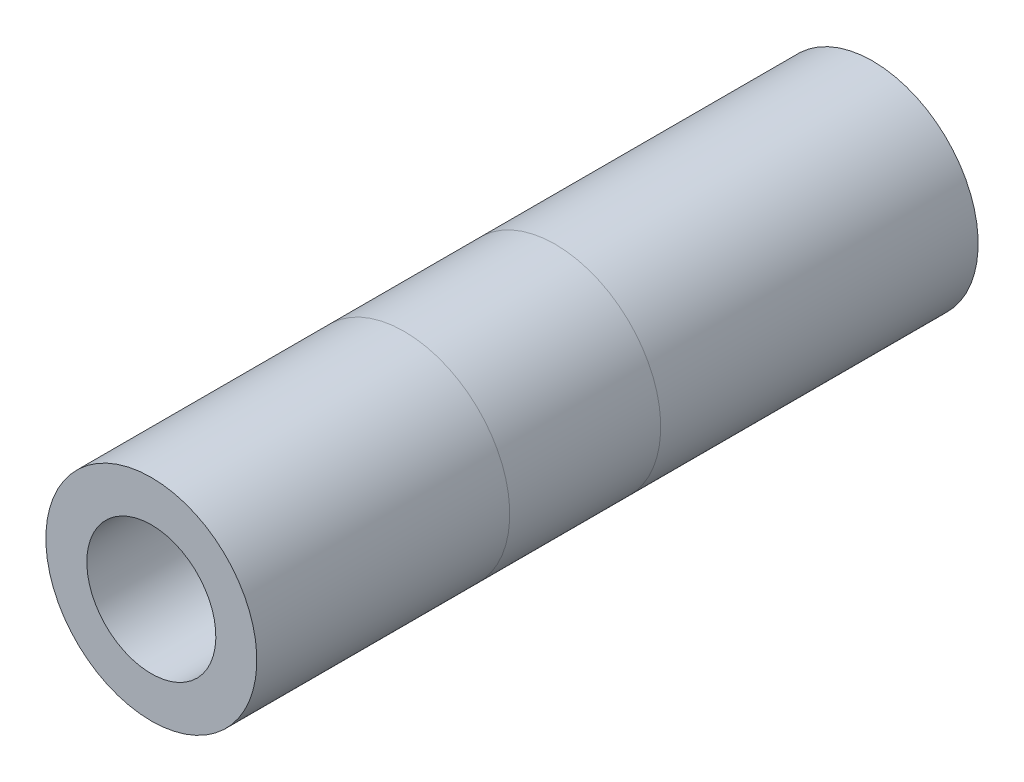
ISO-10303-21;
HEADER;
FILE_DESCRIPTION(('STEP AP214'),'2;1');
FILE_NAME('part.step','',(''),(''),'','','');
FILE_SCHEMA(('AUTOMOTIVE_DESIGN { 1 0 10303 214 1 1 1 1 }'));
ENDSEC;
DATA;
#1=APPLICATION_CONTEXT('core data for automotive mechanical design processes');
#2=APPLICATION_PROTOCOL_DEFINITION('international standard','automotive_design',2000,#1);
#3=PRODUCT_CONTEXT('',#1,'mechanical');
#4=PRODUCT('Part','Part','',(#3));
#5=PRODUCT_RELATED_PRODUCT_CATEGORY('part','',(#4));
#6=PRODUCT_DEFINITION_FORMATION('','',#4);
#7=PRODUCT_DEFINITION_CONTEXT('part definition',#1,'design');
#8=PRODUCT_DEFINITION('design','',#6,#7);
#9=PRODUCT_DEFINITION_SHAPE('','',#8);
#10=(LENGTH_UNIT() NAMED_UNIT(*) SI_UNIT(.MILLI.,.METRE.));
#11=(NAMED_UNIT(*) PLANE_ANGLE_UNIT() SI_UNIT($,.RADIAN.));
#12=(NAMED_UNIT(*) SI_UNIT($,.STERADIAN.) SOLID_ANGLE_UNIT());
#13=UNCERTAINTY_MEASURE_WITH_UNIT(LENGTH_MEASURE(1.E-05),#10,'distance_accuracy_value','');
#14=(GEOMETRIC_REPRESENTATION_CONTEXT(3) GLOBAL_UNCERTAINTY_ASSIGNED_CONTEXT((#13)) GLOBAL_UNIT_ASSIGNED_CONTEXT((#10,
#11,#12)) REPRESENTATION_CONTEXT('',''));
#15=CARTESIAN_POINT('',(0.,0.,0.));
#16=DIRECTION('',(0.,0.,1.));
#17=DIRECTION('',(1.,0.,0.));
#18=AXIS2_PLACEMENT_3D('',#15,#16,#17);
#19=CARTESIAN_POINT('',(-46.0299999999996,4.42627169165701E-13,31.3016264683147));
#20=DIRECTION('',(0.,0.,-1.));
#21=DIRECTION('',(0.,1.,0.));
#22=AXIS2_PLACEMENT_3D('',#19,#20,#21);
#23=PLANE('',#22);
#24=CARTESIAN_POINT('',(-46.0299999999996,4.42627169165701E-13,31.3016264683147));
#25=DIRECTION('',(0.,0.,-1.));
#26=DIRECTION('',(0.,1.,0.));
#27=AXIS2_PLACEMENT_3D('',#24,#25,#26);
#28=CIRCLE('',#27,5.);
#29=CARTESIAN_POINT('',(-46.0299999999996,5.00000000000044,31.3016264683147));
#30=VERTEX_POINT('',#29);
#31=EDGE_CURVE('E76',#30,#30,#28,.F.);
#32=ORIENTED_EDGE('',*,*,#31,.F.);
#33=EDGE_LOOP('',(#32));
#34=FACE_BOUND('',#33,.T.);
#35=CARTESIAN_POINT('',(-46.0299999999996,4.42627169165701E-13,31.3016264683147));
#36=DIRECTION('',(0.,0.,-1.));
#37=DIRECTION('',(0.,1.,0.));
#38=AXIS2_PLACEMENT_3D('',#35,#36,#37);
#39=CIRCLE('',#38,8.175);
#40=CARTESIAN_POINT('',(-46.0299999999996,8.17500000000044,31.3016264683147));
#41=VERTEX_POINT('',#40);
#42=EDGE_CURVE('E71',#41,#41,#39,.T.);
#43=ORIENTED_EDGE('',*,*,#42,.F.);
#44=EDGE_LOOP('',(#43));
#45=FACE_BOUND('',#44,.T.);
#46=ADVANCED_FACE('F57',(#34,#45),#23,.F.);
#47=CARTESIAN_POINT('',(-46.03,0.,-24.5999999999999));
#48=DIRECTION('',(0.,0.,-1.));
#49=DIRECTION('',(0.,1.,0.));
#50=AXIS2_PLACEMENT_3D('',#47,#48,#49);
#51=PLANE('',#50);
#52=CARTESIAN_POINT('',(-46.030000000001,-1.1393832554663E-12,-24.5999999999999));
#53=DIRECTION('',(0.,0.,-1.));
#54=DIRECTION('',(0.,1.,0.));
#55=AXIS2_PLACEMENT_3D('',#52,#53,#54);
#56=CIRCLE('',#55,5.);
#57=CARTESIAN_POINT('',(-46.030000000001,4.99999999999886,-24.5999999999999));
#58=VERTEX_POINT('',#57);
#59=EDGE_CURVE('E77',#58,#58,#56,.F.);
#60=ORIENTED_EDGE('',*,*,#59,.T.);
#61=EDGE_LOOP('',(#60));
#62=FACE_BOUND('',#61,.T.);
#63=CARTESIAN_POINT('',(-46.03,0.,-24.5999999999999));
#64=DIRECTION('',(0.,0.,-1.));
#65=DIRECTION('',(0.,1.,0.));
#66=AXIS2_PLACEMENT_3D('',#63,#64,#65);
#67=CIRCLE('',#66,8.175);
#68=CARTESIAN_POINT('',(-46.03,8.17500000000002,-24.5999999999999));
#69=VERTEX_POINT('',#68);
#70=EDGE_CURVE('E11',#69,#69,#67,.T.);
#71=ORIENTED_EDGE('',*,*,#70,.T.);
#72=EDGE_LOOP('',(#71));
#73=FACE_BOUND('',#72,.T.);
#74=ADVANCED_FACE('F94',(#62,#73),#51,.T.);
#75=CARTESIAN_POINT('',(-46.0299999999996,4.42627169165701E-13,31.3016264683147));
#76=DIRECTION('',(0.,0.,-1.));
#77=DIRECTION('',(-1.,0.,0.));
#78=AXIS2_PLACEMENT_3D('',#75,#76,#77);
#79=CYLINDRICAL_SURFACE('',#78,8.175);
#80=CARTESIAN_POINT('',(-46.0299999999996,4.32834212964584E-13,11.7000469580002));
#81=DIRECTION('',(0.,0.,-1.));
#82=DIRECTION('',(0.,1.,0.));
#83=AXIS2_PLACEMENT_3D('',#80,#81,#82);
#84=CIRCLE('',#83,8.175);
#85=CARTESIAN_POINT('',(-46.0299999999996,8.17500000000044,11.7000469580002));
#86=VERTEX_POINT('',#85);
#87=EDGE_CURVE('E67',#86,#86,#84,.T.);
#88=ORIENTED_EDGE('',*,*,#87,.F.);
#89=EDGE_LOOP('',(#88));
#90=FACE_BOUND('',#89,.T.);
#91=ORIENTED_EDGE('',*,*,#42,.T.);
#92=EDGE_LOOP('',(#91));
#93=FACE_BOUND('',#92,.T.);
#94=ADVANCED_FACE('F98',(#90,#93),#79,.T.);
#95=CARTESIAN_POINT('',(-46.0300000000006,-7.07353857110939E-13,11.7000469579987));
#96=DIRECTION('',(0.,0.,-1.));
#97=DIRECTION('',(0.,1.,0.));
#98=AXIS2_PLACEMENT_3D('',#95,#96,#97);
#99=CYLINDRICAL_SURFACE('',#98,8.175);
#100=CARTESIAN_POINT('',(-46.030000000001,-1.13938325546625E-12,-4.66293670342566E-12));
#101=DIRECTION('',(0.,0.,-1.));
#102=DIRECTION('',(0.,1.,0.));
#103=AXIS2_PLACEMENT_3D('',#100,#101,#102);
#104=CIRCLE('',#103,8.175);
#105=CARTESIAN_POINT('',(-46.030000000001,8.17499999999886,-4.6670209363775E-12));
#106=VERTEX_POINT('',#105);
#107=EDGE_CURVE('E63',#106,#106,#104,.T.);
#108=ORIENTED_EDGE('',*,*,#107,.F.);
#109=EDGE_LOOP('',(#108));
#110=FACE_BOUND('',#109,.T.);
#111=ORIENTED_EDGE('',*,*,#87,.T.);
#112=EDGE_LOOP('',(#111));
#113=FACE_BOUND('',#112,.T.);
#114=ADVANCED_FACE('F100',(#110,#113),#99,.T.);
#115=CARTESIAN_POINT('',(-46.03,0.,-3.09474668114262E-12));
#116=DIRECTION('',(0.,0.,-1.));
#117=DIRECTION('',(-1.,0.,0.));
#118=AXIS2_PLACEMENT_3D('',#115,#116,#117);
#119=CYLINDRICAL_SURFACE('',#118,8.175);
#120=ORIENTED_EDGE('',*,*,#70,.F.);
#121=EDGE_LOOP('',(#120));
#122=FACE_BOUND('',#121,.T.);
#123=ORIENTED_EDGE('',*,*,#107,.T.);
#124=EDGE_LOOP('',(#123));
#125=FACE_BOUND('',#124,.T.);
#126=ADVANCED_FACE('F107',(#122,#125),#119,.T.);
#127=CARTESIAN_POINT('',(-46.030000000001,-1.1393832554663E-12,-4.64905891561784E-12));
#128=DIRECTION('',(0.,0.,-1.));
#129=DIRECTION('',(-1.,0.,0.));
#130=AXIS2_PLACEMENT_3D('',#127,#128,#129);
#131=CYLINDRICAL_SURFACE('',#130,5.);
#132=CARTESIAN_POINT('',(-46.0300000000011,-1.1393832554663E-12,-4.69763117294519E-12));
#133=DIRECTION('',(0.,0.,-1.));
#134=DIRECTION('',(0.,1.,0.));
#135=AXIS2_PLACEMENT_3D('',#132,#133,#134);
#136=CIRCLE('',#135,5.);
#137=CARTESIAN_POINT('',(-46.0300000000011,4.99999999999886,-4.7001291747506E-12));
#138=VERTEX_POINT('',#137);
#139=EDGE_CURVE('E81',#138,#138,#136,.T.);
#140=ORIENTED_EDGE('',*,*,#139,.F.);
#141=EDGE_LOOP('',(#140));
#142=FACE_BOUND('',#141,.T.);
#143=ORIENTED_EDGE('',*,*,#59,.F.);
#144=EDGE_LOOP('',(#143));
#145=FACE_BOUND('',#144,.T.);
#146=ADVANCED_FACE('F95',(#142,#145),#131,.F.);
#147=CARTESIAN_POINT('',(-46.0299999999996,4.43126769526782E-13,32.3016264683147));
#148=DIRECTION('',(0.,0.,-1.));
#149=DIRECTION('',(-1.,0.,0.));
#150=AXIS2_PLACEMENT_3D('',#147,#148,#149);
#151=CYLINDRICAL_SURFACE('',#150,5.);
#152=ORIENTED_EDGE('',*,*,#31,.T.);
#153=EDGE_LOOP('',(#152));
#154=FACE_BOUND('',#153,.T.);
#155=CARTESIAN_POINT('',(-46.0299999999996,4.32834212964584E-13,11.7000469580002));
#156=DIRECTION('',(0.,0.,-1.));
#157=DIRECTION('',(0.,1.,0.));
#158=AXIS2_PLACEMENT_3D('',#155,#156,#157);
#159=CIRCLE('',#158,5.);
#160=CARTESIAN_POINT('',(-46.0299999999996,5.00000000000043,11.7000469580001));
#161=VERTEX_POINT('',#160);
#162=EDGE_CURVE('E80',#161,#161,#159,.T.);
#163=ORIENTED_EDGE('',*,*,#162,.T.);
#164=EDGE_LOOP('',(#163));
#165=FACE_BOUND('',#164,.T.);
#166=ADVANCED_FACE('F89',(#154,#165),#151,.F.);
#167=CARTESIAN_POINT('',(-46.0300000000007,-7.07353857110997E-13,11.7000469579986));
#168=DIRECTION('',(0.,0.,-1.));
#169=DIRECTION('',(0.,1.,0.));
#170=AXIS2_PLACEMENT_3D('',#167,#168,#169);
#171=CYLINDRICAL_SURFACE('',#170,5.);
#172=ORIENTED_EDGE('',*,*,#139,.T.);
#173=EDGE_LOOP('',(#172));
#174=FACE_BOUND('',#173,.T.);
#175=ORIENTED_EDGE('',*,*,#162,.F.);
#176=EDGE_LOOP('',(#175));
#177=FACE_BOUND('',#176,.T.);
#178=ADVANCED_FACE('F120',(#174,#177),#171,.F.);
#179=CLOSED_SHELL('',(#46,#74,#94,#114,#126,#146,#166,#178));
#180=MANIFOLD_SOLID_BREP('B2',#179);
#181=ADVANCED_BREP_SHAPE_REPRESENTATION('',(#18,#180),#14);
#182=SHAPE_DEFINITION_REPRESENTATION(#9,#181);
ENDSEC;
END-ISO-10303-21;
